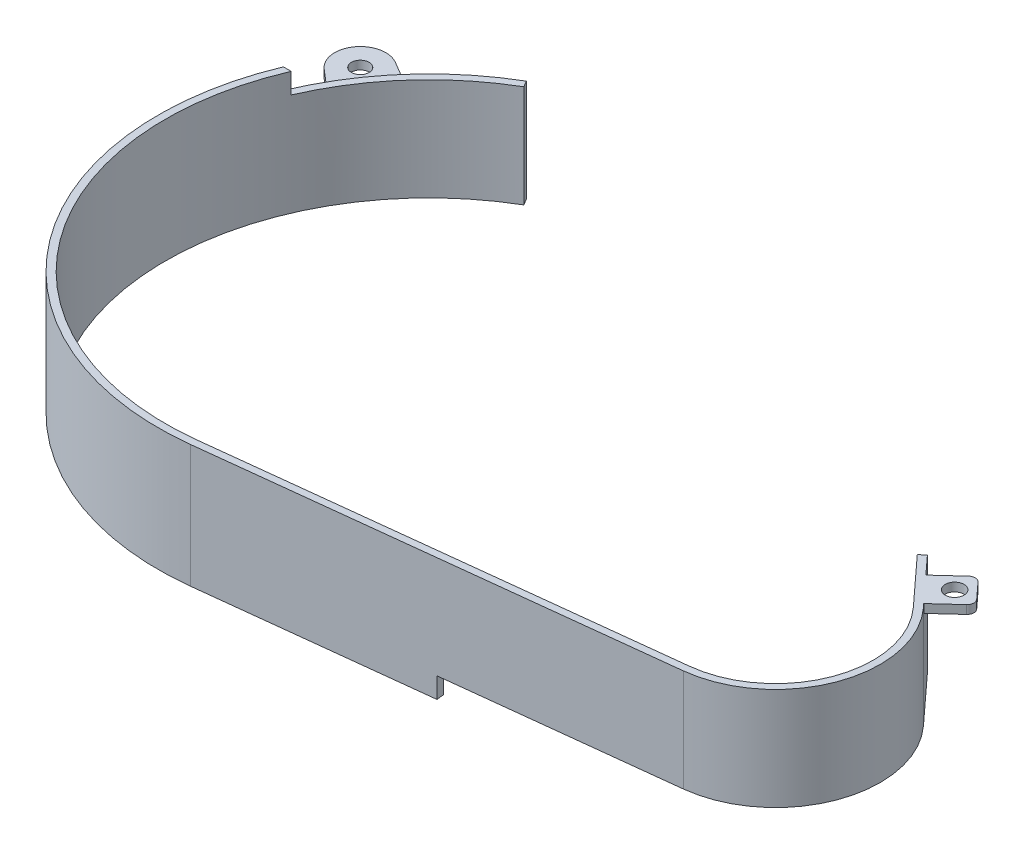
ISO-10303-21;
HEADER;
FILE_DESCRIPTION(('STEP AP214'),'2;1');
FILE_NAME('part.step','',(''),(''),'','','');
FILE_SCHEMA(('AUTOMOTIVE_DESIGN { 1 0 10303 214 1 1 1 1 }'));
ENDSEC;
DATA;
#1=APPLICATION_CONTEXT('core data for automotive mechanical design processes');
#2=APPLICATION_PROTOCOL_DEFINITION('international standard','automotive_design',2000,#1);
#3=PRODUCT_CONTEXT('',#1,'mechanical');
#4=PRODUCT('Part','Part','',(#3));
#5=PRODUCT_RELATED_PRODUCT_CATEGORY('part','',(#4));
#6=PRODUCT_DEFINITION_FORMATION('','',#4);
#7=PRODUCT_DEFINITION_CONTEXT('part definition',#1,'design');
#8=PRODUCT_DEFINITION('design','',#6,#7);
#9=PRODUCT_DEFINITION_SHAPE('','',#8);
#10=(LENGTH_UNIT() NAMED_UNIT(*) SI_UNIT(.MILLI.,.METRE.));
#11=(NAMED_UNIT(*) PLANE_ANGLE_UNIT() SI_UNIT($,.RADIAN.));
#12=(NAMED_UNIT(*) SI_UNIT($,.STERADIAN.) SOLID_ANGLE_UNIT());
#13=UNCERTAINTY_MEASURE_WITH_UNIT(LENGTH_MEASURE(1.E-05),#10,'distance_accuracy_value','');
#14=(GEOMETRIC_REPRESENTATION_CONTEXT(3) GLOBAL_UNCERTAINTY_ASSIGNED_CONTEXT((#13)) GLOBAL_UNIT_ASSIGNED_CONTEXT((#10,
#11,#12)) REPRESENTATION_CONTEXT('',''));
#15=CARTESIAN_POINT('',(0.,0.,0.));
#16=DIRECTION('',(0.,0.,1.));
#17=DIRECTION('',(1.,0.,0.));
#18=AXIS2_PLACEMENT_3D('',#15,#16,#17);
#19=CARTESIAN_POINT('',(-718.812633407999,-38.1,-0.538847823074007));
#20=DIRECTION('',(0.863505690985107,0.,-0.504339093900455));
#21=DIRECTION('',(-0.504339093900455,0.,-0.863505690985107));
#22=AXIS2_PLACEMENT_3D('',#19,#20,#21);
#23=PLANE('',#22);
#24=DIRECTION('',(0.,1.,0.));
#25=VECTOR('',#24,1.);
#26=CARTESIAN_POINT('',(-720.157705771432,-38.1,-2.84181750093129));
#27=LINE('',#26,#25);
#28=CARTESIAN_POINT('',(-720.157705771432,-45.72,-2.84181750093129));
#29=VERTEX_POINT('',#28);
#30=CARTESIAN_POINT('',(-720.157705771432,-7.62,-2.84181750093128));
#31=VERTEX_POINT('',#30);
#32=EDGE_CURVE('E402',#29,#31,#27,.T.);
#33=ORIENTED_EDGE('',*,*,#32,.T.);
#34=DIRECTION('',(-0.504339093900455,0.,-0.863505690985107));
#35=VECTOR('',#34,1.);
#36=CARTESIAN_POINT('',(-718.812633407999,-7.62,-0.538847823074007));
#37=LINE('',#36,#35);
#38=CARTESIAN_POINT('',(-718.812633407999,-7.62,-0.538847823074007));
#39=VERTEX_POINT('',#38);
#40=EDGE_CURVE('E329',#39,#31,#37,.T.);
#41=ORIENTED_EDGE('',*,*,#40,.F.);
#42=DIRECTION('',(0.,1.,0.));
#43=VECTOR('',#42,1.);
#44=CARTESIAN_POINT('',(-718.812633407999,-38.1,-0.538847823074007));
#45=LINE('',#44,#43);
#46=CARTESIAN_POINT('',(-718.812633407999,-45.72,-0.538847823074007));
#47=VERTEX_POINT('',#46);
#48=EDGE_CURVE('E47',#47,#39,#45,.T.);
#49=ORIENTED_EDGE('',*,*,#48,.F.);
#50=DIRECTION('',(0.504339093900453,0.,0.863505690985109));
#51=VECTOR('',#50,1.);
#52=CARTESIAN_POINT('',(-718.812633407999,-45.72,-0.538847823074007));
#53=LINE('',#52,#51);
#54=EDGE_CURVE('E278',#29,#47,#53,.T.);
#55=ORIENTED_EDGE('',*,*,#54,.F.);
#56=EDGE_LOOP('',(#33,#41,#49,#55));
#57=FACE_BOUND('',#56,.T.);
#58=ADVANCED_FACE('F43',(#57),#23,.T.);
#59=CARTESIAN_POINT('',(-669.29,-38.1,84.2514773719377));
#60=DIRECTION('',(0.,1.,0.));
#61=DIRECTION('',(0.,0.,1.));
#62=AXIS2_PLACEMENT_3D('',#59,#60,#61);
#63=CYLINDRICAL_SURFACE('',#62,98.1931284069251);
#64=DIRECTION('',(0.,1.,0.));
#65=VECTOR('',#64,1.);
#66=CARTESIAN_POINT('',(-759.477946398927,-7.62,45.4181824990687));
#67=LINE('',#66,#65);
#68=CARTESIAN_POINT('',(-759.477946398927,-7.62,45.4181824990687));
#69=VERTEX_POINT('',#68);
#70=CARTESIAN_POINT('',(-759.477946398927,0.,45.4181824990687));
#71=VERTEX_POINT('',#70);
#72=EDGE_CURVE('E338',#69,#71,#67,.T.);
#73=ORIENTED_EDGE('',*,*,#72,.T.);
#74=CARTESIAN_POINT('',(-669.29,0.,84.2514773719377));
#75=DIRECTION('',(0.,-1.,0.));
#76=DIRECTION('',(0.,0.,-1.));
#77=AXIS2_PLACEMENT_3D('',#74,#75,#76);
#78=CIRCLE('',#77,98.1931284069251);
#79=CARTESIAN_POINT('',(-658.188390000205,0.,181.815019342037));
#80=VERTEX_POINT('',#79);
#81=EDGE_CURVE('E341',#80,#71,#78,.T.);
#82=ORIENTED_EDGE('',*,*,#81,.F.);
#83=DIRECTION('',(0.,1.,0.));
#84=VECTOR('',#83,1.);
#85=CARTESIAN_POINT('',(-658.188390000205,-38.1,181.815019342037));
#86=LINE('',#85,#84);
#87=CARTESIAN_POINT('',(-658.188390000205,-45.72,181.815019342037));
#88=VERTEX_POINT('',#87);
#89=EDGE_CURVE('E12',#88,#80,#86,.T.);
#90=ORIENTED_EDGE('',*,*,#89,.F.);
#91=CARTESIAN_POINT('',(-669.29,-45.72,84.2514773719377));
#92=DIRECTION('',(0.,1.,0.));
#93=DIRECTION('',(0.,0.,-1.));
#94=AXIS2_PLACEMENT_3D('',#91,#92,#93);
#95=CIRCLE('',#94,98.1931284069251);
#96=EDGE_CURVE('E265',#47,#88,#95,.T.);
#97=ORIENTED_EDGE('',*,*,#96,.F.);
#98=ORIENTED_EDGE('',*,*,#48,.T.);
#99=CARTESIAN_POINT('',(-669.29,-7.62,84.2514773719377));
#100=DIRECTION('',(0.,-1.,0.));
#101=DIRECTION('',(0.,0.,1.));
#102=AXIS2_PLACEMENT_3D('',#99,#100,#101);
#103=CIRCLE('',#102,98.1931284069251);
#104=EDGE_CURVE('E327',#69,#39,#103,.T.);
#105=ORIENTED_EDGE('',*,*,#104,.F.);
#106=EDGE_LOOP('',(#73,#82,#90,#97,#98,#105));
#107=FACE_BOUND('',#106,.T.);
#108=ADVANCED_FACE('F45',(#107),#63,.F.);
#109=CARTESIAN_POINT('',(-658.188390000205,-38.1,181.815019342037));
#110=DIRECTION('',(-0.113058929681808,0.,-0.993588284159593));
#111=DIRECTION('',(-0.993588284159593,0.,0.113058929681808));
#112=AXIS2_PLACEMENT_3D('',#109,#110,#111);
#113=PLANE('',#112);
#114=DIRECTION('',(-0.993588284159593,0.,0.113058929681808));
#115=VECTOR('',#114,1.);
#116=CARTESIAN_POINT('',(-658.188390000205,0.,181.815019342037));
#117=LINE('',#116,#115);
#118=CARTESIAN_POINT('',(-493.414651071668,0.,163.065661222655));
#119=VERTEX_POINT('',#118);
#120=EDGE_CURVE('E346',#119,#80,#117,.T.);
#121=ORIENTED_EDGE('',*,*,#120,.F.);
#122=DIRECTION('',(0.,1.,0.));
#123=VECTOR('',#122,1.);
#124=CARTESIAN_POINT('',(-493.414651071668,-38.1,163.065661222655));
#125=LINE('',#124,#123);
#126=CARTESIAN_POINT('',(-493.414651071668,-38.1,163.065661222655));
#127=VERTEX_POINT('',#126);
#128=EDGE_CURVE('E52',#127,#119,#125,.T.);
#129=ORIENTED_EDGE('',*,*,#128,.F.);
#130=DIRECTION('',(-0.993588284159593,0.,0.113058929681808));
#131=VECTOR('',#130,1.);
#132=CARTESIAN_POINT('',(-658.188390000205,-38.1,181.815019342037));
#133=LINE('',#132,#131);
#134=CARTESIAN_POINT('',(-575.801520535936,-38.1,172.440340282346));
#135=VERTEX_POINT('',#134);
#136=EDGE_CURVE('E361',#127,#135,#133,.T.);
#137=ORIENTED_EDGE('',*,*,#136,.T.);
#138=DIRECTION('',(0.,1.,0.));
#139=VECTOR('',#138,1.);
#140=CARTESIAN_POINT('',(-575.801520535936,-45.72,172.440340282346));
#141=LINE('',#140,#139);
#142=CARTESIAN_POINT('',(-575.801520535936,-45.72,172.440340282346));
#143=VERTEX_POINT('',#142);
#144=EDGE_CURVE('E285',#143,#135,#141,.T.);
#145=ORIENTED_EDGE('',*,*,#144,.F.);
#146=DIRECTION('',(0.993588284159593,0.,-0.113058929681808));
#147=VECTOR('',#146,1.);
#148=CARTESIAN_POINT('',(-575.801520535936,-45.72,172.440340282346));
#149=LINE('',#148,#147);
#150=EDGE_CURVE('E268',#88,#143,#149,.T.);
#151=ORIENTED_EDGE('',*,*,#150,.F.);
#152=ORIENTED_EDGE('',*,*,#89,.T.);
#153=EDGE_LOOP('',(#121,#129,#137,#145,#151,#152));
#154=FACE_BOUND('',#153,.T.);
#155=ADVANCED_FACE('F433',(#154),#113,.T.);
#156=CARTESIAN_POINT('',(-497.518508898001,-38.1,126.999999999997));
#157=DIRECTION('',(0.,1.,0.));
#158=DIRECTION('',(0.,0.,1.));
#159=AXIS2_PLACEMENT_3D('',#156,#157,#158);
#160=CYLINDRICAL_SURFACE('',#159,36.2983962247135);
#161=CARTESIAN_POINT('',(-497.518508898001,0.,126.999999999997));
#162=DIRECTION('',(0.,-1.,0.));
#163=DIRECTION('',(0.,0.,1.));
#164=AXIS2_PLACEMENT_3D('',#161,#162,#163);
#165=CIRCLE('',#164,36.2983962247135);
#166=CARTESIAN_POINT('',(-470.767754496425,0.,102.464908652442));
#167=VERTEX_POINT('',#166);
#168=EDGE_CURVE('E383',#167,#119,#165,.T.);
#169=ORIENTED_EDGE('',*,*,#168,.F.);
#170=DIRECTION('',(0.,1.,0.));
#171=VECTOR('',#170,1.);
#172=CARTESIAN_POINT('',(-470.767754496425,-38.1,102.464908652442));
#173=LINE('',#172,#171);
#174=CARTESIAN_POINT('',(-470.767754496425,-38.1,102.464908652442));
#175=VERTEX_POINT('',#174);
#176=EDGE_CURVE('E389',#175,#167,#173,.T.);
#177=ORIENTED_EDGE('',*,*,#176,.F.);
#178=CARTESIAN_POINT('',(-497.518508898001,-38.1,126.999999999997));
#179=DIRECTION('',(0.,-1.,0.));
#180=DIRECTION('',(0.,0.,1.));
#181=AXIS2_PLACEMENT_3D('',#178,#179,#180);
#182=CIRCLE('',#181,36.2983962247135);
#183=EDGE_CURVE('E358',#175,#127,#182,.T.);
#184=ORIENTED_EDGE('',*,*,#183,.T.);
#185=ORIENTED_EDGE('',*,*,#128,.T.);
#186=EDGE_LOOP('',(#169,#177,#184,#185));
#187=FACE_BOUND('',#186,.T.);
#188=ADVANCED_FACE('F495',(#187),#160,.F.);
#189=CARTESIAN_POINT('',(-470.767754496425,-38.1,102.464908652442));
#190=DIRECTION('',(-0.736967943045437,0.,0.675927696520403));
#191=DIRECTION('',(0.675927696520403,0.,0.736967943045437));
#192=AXIS2_PLACEMENT_3D('',#189,#190,#191);
#193=PLANE('',#192);
#194=DIRECTION('',(0.675927696520403,0.,0.736967943045437));
#195=VECTOR('',#194,1.);
#196=CARTESIAN_POINT('',(-470.767754496425,0.,102.464908652442));
#197=LINE('',#196,#195);
#198=CARTESIAN_POINT('',(-487.06246977756,0.,84.6986847425939));
#199=VERTEX_POINT('',#198);
#200=EDGE_CURVE('E380',#199,#167,#197,.T.);
#201=ORIENTED_EDGE('',*,*,#200,.F.);
#202=DIRECTION('',(0.,1.,0.));
#203=VECTOR('',#202,1.);
#204=CARTESIAN_POINT('',(-487.06246977756,-38.1,84.6986847425939));
#205=LINE('',#204,#203);
#206=CARTESIAN_POINT('',(-487.06246977756,-38.1,84.6986847425939));
#207=VERTEX_POINT('',#206);
#208=EDGE_CURVE('E391',#207,#199,#205,.T.);
#209=ORIENTED_EDGE('',*,*,#208,.F.);
#210=DIRECTION('',(0.675927696520403,0.,0.736967943045437));
#211=VECTOR('',#210,1.);
#212=CARTESIAN_POINT('',(-470.767754496425,-38.1,102.464908652442));
#213=LINE('',#212,#211);
#214=EDGE_CURVE('E355',#207,#175,#213,.T.);
#215=ORIENTED_EDGE('',*,*,#214,.T.);
#216=ORIENTED_EDGE('',*,*,#176,.T.);
#217=EDGE_LOOP('',(#201,#209,#215,#216));
#218=FACE_BOUND('',#217,.T.);
#219=ADVANCED_FACE('F491',(#218),#193,.T.);
#220=CARTESIAN_POINT('',(-487.06246977756,-38.1,84.6986847425939));
#221=DIRECTION('',(-0.675927696520402,0.,-0.736967943045438));
#222=DIRECTION('',(-0.736967943045438,0.,0.675927696520402));
#223=AXIS2_PLACEMENT_3D('',#220,#221,#222);
#224=PLANE('',#223);
#225=DIRECTION('',(-0.736967943045438,0.,0.675927696520402));
#226=VECTOR('',#225,1.);
#227=CARTESIAN_POINT('',(-487.06246977756,0.,84.6986847425939));
#228=LINE('',#227,#226);
#229=CARTESIAN_POINT('',(-485.096976273458,0.,82.8959855759739));
#230=VERTEX_POINT('',#229);
#231=EDGE_CURVE('E377',#230,#199,#228,.T.);
#232=ORIENTED_EDGE('',*,*,#231,.F.);
#233=DIRECTION('',(0.,1.,0.));
#234=VECTOR('',#233,1.);
#235=CARTESIAN_POINT('',(-485.096976273458,-38.1,82.8959855759739));
#236=LINE('',#235,#234);
#237=CARTESIAN_POINT('',(-485.096976273458,-38.1,82.8959855759739));
#238=VERTEX_POINT('',#237);
#239=EDGE_CURVE('E393',#238,#230,#236,.T.);
#240=ORIENTED_EDGE('',*,*,#239,.F.);
#241=DIRECTION('',(-0.736967943045438,0.,0.675927696520402));
#242=VECTOR('',#241,1.);
#243=CARTESIAN_POINT('',(-487.06246977756,-38.1,84.6986847425939));
#244=LINE('',#243,#242);
#245=EDGE_CURVE('E352',#238,#207,#244,.T.);
#246=ORIENTED_EDGE('',*,*,#245,.T.);
#247=ORIENTED_EDGE('',*,*,#208,.T.);
#248=EDGE_LOOP('',(#232,#240,#246,#247));
#249=FACE_BOUND('',#248,.T.);
#250=ADVANCED_FACE('F488',(#249),#224,.T.);
#251=CARTESIAN_POINT('',(-468.802260992323,-38.1,100.662209485822));
#252=DIRECTION('',(0.736967943045436,0.,-0.675927696520403));
#253=DIRECTION('',(-0.675927696520403,0.,-0.736967943045436));
#254=AXIS2_PLACEMENT_3D('',#251,#252,#253);
#255=PLANE('',#254);
#256=DIRECTION('',(0.,1.,0.));
#257=VECTOR('',#256,1.);
#258=CARTESIAN_POINT('',(-470.0899032542,-3.175,99.2582855543139));
#259=LINE('',#258,#257);
#260=CARTESIAN_POINT('',(-470.0899032542,-3.175,99.2582855543139));
#261=VERTEX_POINT('',#260);
#262=CARTESIAN_POINT('',(-470.0899032542,0.,99.2582855543139));
#263=VERTEX_POINT('',#262);
#264=EDGE_CURVE('E231',#261,#263,#259,.T.);
#265=ORIENTED_EDGE('',*,*,#264,.T.);
#266=DIRECTION('',(-0.675927696520403,0.,-0.736967943045436));
#267=VECTOR('',#266,1.);
#268=CARTESIAN_POINT('',(-468.802260992323,0.,100.662209485822));
#269=LINE('',#268,#267);
#270=CARTESIAN_POINT('',(-468.802260992323,0.,100.662209485822));
#271=VERTEX_POINT('',#270);
#272=EDGE_CURVE('E374',#271,#263,#269,.T.);
#273=ORIENTED_EDGE('',*,*,#272,.F.);
#274=DIRECTION('',(0.,1.,0.));
#275=VECTOR('',#274,1.);
#276=CARTESIAN_POINT('',(-468.802260992323,-38.1,100.662209485822));
#277=LINE('',#276,#275);
#278=CARTESIAN_POINT('',(-468.802260992323,-38.1,100.662209485822));
#279=VERTEX_POINT('',#278);
#280=EDGE_CURVE('E396',#279,#271,#277,.T.);
#281=ORIENTED_EDGE('',*,*,#280,.F.);
#282=DIRECTION('',(-0.675927696520403,0.,-0.736967943045436));
#283=VECTOR('',#282,1.);
#284=CARTESIAN_POINT('',(-468.802260992323,-38.1,100.662209485822));
#285=LINE('',#284,#283);
#286=EDGE_CURVE('E349',#279,#238,#285,.T.);
#287=ORIENTED_EDGE('',*,*,#286,.T.);
#288=ORIENTED_EDGE('',*,*,#239,.T.);
#289=CARTESIAN_POINT('',(-478.876963308965,0.,89.6777022947233));
#290=VERTEX_POINT('',#289);
#291=EDGE_CURVE('E373',#290,#230,#269,.T.);
#292=ORIENTED_EDGE('',*,*,#291,.F.);
#293=DIRECTION('',(0.,1.,0.));
#294=VECTOR('',#293,1.);
#295=CARTESIAN_POINT('',(-478.876963308965,-3.175,89.6777022947232));
#296=LINE('',#295,#294);
#297=CARTESIAN_POINT('',(-478.876963308965,-3.175,89.6777022947232));
#298=VERTEX_POINT('',#297);
#299=EDGE_CURVE('E258',#298,#290,#296,.T.);
#300=ORIENTED_EDGE('',*,*,#299,.F.);
#301=DIRECTION('',(-0.675927696520403,0.,-0.736967943045436));
#302=VECTOR('',#301,1.);
#303=CARTESIAN_POINT('',(-304.76027945231,-3.175,279.518146786493));
#304=LINE('',#303,#302);
#305=EDGE_CURVE('E217',#261,#298,#304,.T.);
#306=ORIENTED_EDGE('',*,*,#305,.F.);
#307=EDGE_LOOP('',(#265,#273,#281,#287,#288,#292,#300,#306));
#308=FACE_BOUND('',#307,.T.);
#309=ADVANCED_FACE('F450',(#308),#255,.T.);
#310=CARTESIAN_POINT('',(-497.518508898001,-38.1,126.999999999997));
#311=DIRECTION('',(0.,1.,0.));
#312=DIRECTION('',(0.,0.,1.));
#313=AXIS2_PLACEMENT_3D('',#310,#311,#312);
#314=CYLINDRICAL_SURFACE('',#313,38.9653962247135);
#315=CARTESIAN_POINT('',(-497.518508898001,0.,126.999999999997));
#316=DIRECTION('',(0.,1.,0.));
#317=DIRECTION('',(0.,0.,1.));
#318=AXIS2_PLACEMENT_3D('',#315,#316,#317);
#319=CIRCLE('',#318,38.9653962247135);
#320=CARTESIAN_POINT('',(-493.113122906207,0.,165.715561176509));
#321=VERTEX_POINT('',#320);
#322=EDGE_CURVE('E370',#321,#271,#319,.T.);
#323=ORIENTED_EDGE('',*,*,#322,.F.);
#324=DIRECTION('',(0.,1.,0.));
#325=VECTOR('',#324,1.);
#326=CARTESIAN_POINT('',(-493.113122906207,-38.1,165.715561176509));
#327=LINE('',#326,#325);
#328=CARTESIAN_POINT('',(-493.113122906207,-38.1,165.715561176509));
#329=VERTEX_POINT('',#328);
#330=EDGE_CURVE('E398',#329,#321,#327,.T.);
#331=ORIENTED_EDGE('',*,*,#330,.F.);
#332=CARTESIAN_POINT('',(-497.518508898001,-38.1,126.999999999997));
#333=DIRECTION('',(0.,1.,0.));
#334=DIRECTION('',(0.,0.,1.));
#335=AXIS2_PLACEMENT_3D('',#332,#333,#334);
#336=CIRCLE('',#335,38.9653962247135);
#337=EDGE_CURVE('E345',#329,#279,#336,.T.);
#338=ORIENTED_EDGE('',*,*,#337,.T.);
#339=ORIENTED_EDGE('',*,*,#280,.T.);
#340=EDGE_LOOP('',(#323,#331,#338,#339));
#341=FACE_BOUND('',#340,.T.);
#342=ADVANCED_FACE('F446',(#341),#314,.T.);
#343=CARTESIAN_POINT('',(-657.886861834743,-38.1,184.464919295891));
#344=DIRECTION('',(0.113058929681808,0.,0.993588284159593));
#345=DIRECTION('',(0.993588284159593,0.,-0.113058929681808));
#346=AXIS2_PLACEMENT_3D('',#343,#344,#345);
#347=PLANE('',#346);
#348=DIRECTION('',(0.993588284159593,0.,-0.113058929681808));
#349=VECTOR('',#348,1.);
#350=CARTESIAN_POINT('',(-657.886861834743,0.,184.464919295891));
#351=LINE('',#350,#349);
#352=CARTESIAN_POINT('',(-657.886861834743,0.,184.464919295891));
#353=VERTEX_POINT('',#352);
#354=EDGE_CURVE('E367',#353,#321,#351,.T.);
#355=ORIENTED_EDGE('',*,*,#354,.F.);
#356=DIRECTION('',(0.,1.,0.));
#357=VECTOR('',#356,1.);
#358=CARTESIAN_POINT('',(-657.886861834743,-38.1,184.464919295891));
#359=LINE('',#358,#357);
#360=CARTESIAN_POINT('',(-657.886861834743,-45.72,184.464919295891));
#361=VERTEX_POINT('',#360);
#362=EDGE_CURVE('E400',#361,#353,#359,.T.);
#363=ORIENTED_EDGE('',*,*,#362,.F.);
#364=DIRECTION('',(-0.993588284159593,0.,0.113058929681809));
#365=VECTOR('',#364,1.);
#366=CARTESIAN_POINT('',(-657.886861834743,-45.72,184.464919295891));
#367=LINE('',#366,#365);
#368=CARTESIAN_POINT('',(-575.499992370475,-45.72,175.0902402362));
#369=VERTEX_POINT('',#368);
#370=EDGE_CURVE('E272',#369,#361,#367,.T.);
#371=ORIENTED_EDGE('',*,*,#370,.F.);
#372=DIRECTION('',(0.,1.,0.));
#373=VECTOR('',#372,1.);
#374=CARTESIAN_POINT('',(-575.499992370475,-45.72,175.0902402362));
#375=LINE('',#374,#373);
#376=CARTESIAN_POINT('',(-575.499992370475,-38.1,175.0902402362));
#377=VERTEX_POINT('',#376);
#378=EDGE_CURVE('E281',#369,#377,#375,.T.);
#379=ORIENTED_EDGE('',*,*,#378,.T.);
#380=DIRECTION('',(0.993588284159593,0.,-0.113058929681808));
#381=VECTOR('',#380,1.);
#382=CARTESIAN_POINT('',(-657.886861834743,-38.1,184.464919295891));
#383=LINE('',#382,#381);
#384=EDGE_CURVE('E343',#377,#329,#383,.T.);
#385=ORIENTED_EDGE('',*,*,#384,.T.);
#386=ORIENTED_EDGE('',*,*,#330,.T.);
#387=EDGE_LOOP('',(#355,#363,#371,#379,#385,#386));
#388=FACE_BOUND('',#387,.T.);
#389=ADVANCED_FACE('F441',(#388),#347,.T.);
#390=CARTESIAN_POINT('',(-669.29,-38.1,84.2514773719377));
#391=DIRECTION('',(0.,1.,0.));
#392=DIRECTION('',(0.,0.,1.));
#393=AXIS2_PLACEMENT_3D('',#390,#391,#392);
#394=CYLINDRICAL_SURFACE('',#393,100.860128406925);
#395=CARTESIAN_POINT('',(-669.29,-15.10675668,84.2514773719377));
#396=DIRECTION('',(0.,-1.,0.));
#397=DIRECTION('',(0.,0.,-1.));
#398=AXIS2_PLACEMENT_3D('',#395,#396,#397);
#399=CIRCLE('',#398,100.860128406925);
#400=CARTESIAN_POINT('',(-756.947378036046,-15.10675668,34.3621039733153));
#401=VERTEX_POINT('',#400);
#402=CARTESIAN_POINT('',(-744.675064761212,-15.10675668,17.2450783252101));
#403=VERTEX_POINT('',#402);
#404=EDGE_CURVE('E302',#401,#403,#399,.T.);
#405=ORIENTED_EDGE('',*,*,#404,.T.);
#406=DIRECTION('',(0.,1.,0.));
#407=VECTOR('',#406,1.);
#408=CARTESIAN_POINT('',(-744.675064761212,-15.10675668,17.2450783252101));
#409=LINE('',#408,#407);
#410=CARTESIAN_POINT('',(-744.675064761212,-11.93175668,17.2450783252101));
#411=VERTEX_POINT('',#410);
#412=EDGE_CURVE('E320',#403,#411,#409,.T.);
#413=ORIENTED_EDGE('',*,*,#412,.T.);
#414=CARTESIAN_POINT('',(-669.29,-11.93175668,84.2514773719377));
#415=DIRECTION('',(0.,-1.,0.));
#416=DIRECTION('',(0.,0.,-1.));
#417=AXIS2_PLACEMENT_3D('',#414,#415,#416);
#418=CIRCLE('',#417,100.860128406925);
#419=CARTESIAN_POINT('',(-756.947378036046,-11.93175668,34.3621039733153));
#420=VERTEX_POINT('',#419);
#421=EDGE_CURVE('E313',#420,#411,#418,.T.);
#422=ORIENTED_EDGE('',*,*,#421,.F.);
#423=DIRECTION('',(0.,1.,0.));
#424=VECTOR('',#423,1.);
#425=CARTESIAN_POINT('',(-756.947378036046,-15.10675668,34.3621039733153));
#426=LINE('',#425,#424);
#427=EDGE_CURVE('E323',#401,#420,#426,.T.);
#428=ORIENTED_EDGE('',*,*,#427,.F.);
#429=EDGE_LOOP('',(#405,#413,#422,#428));
#430=FACE_BOUND('',#429,.T.);
#431=DIRECTION('',(0.,1.,0.));
#432=VECTOR('',#431,1.);
#433=CARTESIAN_POINT('',(-762.374589012243,-7.62,45.4181824990687));
#434=LINE('',#433,#432);
#435=CARTESIAN_POINT('',(-762.374589012243,-7.62,45.4181824990687));
#436=VERTEX_POINT('',#435);
#437=CARTESIAN_POINT('',(-762.374589012243,0.,45.4181824990687));
#438=VERTEX_POINT('',#437);
#439=EDGE_CURVE('E336',#436,#438,#434,.T.);
#440=ORIENTED_EDGE('',*,*,#439,.F.);
#441=CARTESIAN_POINT('',(-669.29,-7.62,84.2514773719377));
#442=DIRECTION('',(0.,1.,0.));
#443=DIRECTION('',(0.,0.,-1.));
#444=AXIS2_PLACEMENT_3D('',#441,#442,#443);
#445=CIRCLE('',#444,100.860128406925);
#446=EDGE_CURVE('E331',#31,#436,#445,.T.);
#447=ORIENTED_EDGE('',*,*,#446,.F.);
#448=ORIENTED_EDGE('',*,*,#32,.F.);
#449=CARTESIAN_POINT('',(-669.29,-45.72,84.2514773719377));
#450=DIRECTION('',(0.,-1.,0.));
#451=DIRECTION('',(0.,0.,-1.));
#452=AXIS2_PLACEMENT_3D('',#449,#450,#451);
#453=CIRCLE('',#452,100.860128406925);
#454=EDGE_CURVE('E275',#361,#29,#453,.T.);
#455=ORIENTED_EDGE('',*,*,#454,.F.);
#456=ORIENTED_EDGE('',*,*,#362,.T.);
#457=CARTESIAN_POINT('',(-669.29,0.,84.2514773719377));
#458=DIRECTION('',(0.,1.,0.));
#459=DIRECTION('',(0.,0.,-1.));
#460=AXIS2_PLACEMENT_3D('',#457,#458,#459);
#461=CIRCLE('',#460,100.860128406925);
#462=EDGE_CURVE('E365',#438,#353,#461,.T.);
#463=ORIENTED_EDGE('',*,*,#462,.F.);
#464=EDGE_LOOP('',(#440,#447,#448,#455,#456,#463));
#465=FACE_BOUND('',#464,.T.);
#466=ADVANCED_FACE('F417',(#430,#465),#394,.T.);
#467=CARTESIAN_POINT('',(-669.29,-38.1,84.2514773719377));
#468=DIRECTION('',(0.,-1.,0.));
#469=DIRECTION('',(0.,0.,-1.));
#470=AXIS2_PLACEMENT_3D('',#467,#468,#469);
#471=PLANE('',#470);
#472=DIRECTION('',(0.1130589296818,0.,0.993588284159594));
#473=VECTOR('',#472,1.);
#474=CARTESIAN_POINT('',(-575.499992370475,-38.1,175.0902402362));
#475=LINE('',#474,#473);
#476=EDGE_CURVE('E68',#135,#377,#475,.T.);
#477=ORIENTED_EDGE('',*,*,#476,.F.);
#478=ORIENTED_EDGE('',*,*,#136,.F.);
#479=ORIENTED_EDGE('',*,*,#183,.F.);
#480=ORIENTED_EDGE('',*,*,#214,.F.);
#481=ORIENTED_EDGE('',*,*,#245,.F.);
#482=ORIENTED_EDGE('',*,*,#286,.F.);
#483=ORIENTED_EDGE('',*,*,#337,.F.);
#484=ORIENTED_EDGE('',*,*,#384,.F.);
#485=EDGE_LOOP('',(#477,#478,#479,#480,#481,#482,#483,#484));
#486=FACE_BOUND('',#485,.T.);
#487=ADVANCED_FACE('F480',(#486),#471,.T.);
#488=CARTESIAN_POINT('',(-669.29,0.,84.2514773719377));
#489=DIRECTION('',(0.,-1.,0.));
#490=DIRECTION('',(0.,0.,-1.));
#491=AXIS2_PLACEMENT_3D('',#488,#489,#490);
#492=PLANE('',#491);
#493=ORIENTED_EDGE('',*,*,#81,.T.);
#494=DIRECTION('',(1.,0.,0.));
#495=VECTOR('',#494,1.);
#496=CARTESIAN_POINT('',(-759.477946398927,0.,45.4181824990687));
#497=LINE('',#496,#495);
#498=EDGE_CURVE('E319',#438,#71,#497,.T.);
#499=ORIENTED_EDGE('',*,*,#498,.F.);
#500=ORIENTED_EDGE('',*,*,#462,.T.);
#501=ORIENTED_EDGE('',*,*,#354,.T.);
#502=ORIENTED_EDGE('',*,*,#322,.T.);
#503=ORIENTED_EDGE('',*,*,#272,.T.);
#504=DIRECTION('',(0.736967943045435,0.,-0.675927696520405));
#505=VECTOR('',#504,1.);
#506=CARTESIAN_POINT('',(-165.329623801891,0.,-180.25986123218));
#507=LINE('',#506,#505);
#508=CARTESIAN_POINT('',(-461.759954593954,0.,91.6182748005405));
#509=VERTEX_POINT('',#508);
#510=EDGE_CURVE('E248',#263,#509,#507,.T.);
#511=ORIENTED_EDGE('',*,*,#510,.T.);
#512=CARTESIAN_POINT('',(-463.476810943116,0.,89.7463762252051));
#513=DIRECTION('',(0.,1.,0.));
#514=DIRECTION('',(0.,0.,1.));
#515=AXIS2_PLACEMENT_3D('',#512,#513,#514);
#516=CIRCLE('',#515,2.53999999999996);
#517=CARTESIAN_POINT('',(-461.60491236778,0.,88.0295198760433));
#518=VERTEX_POINT('',#517);
#519=EDGE_CURVE('E212',#509,#518,#516,.T.);
#520=ORIENTED_EDGE('',*,*,#519,.T.);
#521=DIRECTION('',(-0.675927696520408,0.,-0.736967943045432));
#522=VECTOR('',#521,1.);
#523=CARTESIAN_POINT('',(-294.558432216726,0.,270.161279683559));
#524=LINE('',#523,#522);
#525=CARTESIAN_POINT('',(-466.958259724222,0.,82.1927337671234));
#526=VERTEX_POINT('',#525);
#527=EDGE_CURVE('E251',#518,#526,#524,.T.);
#528=ORIENTED_EDGE('',*,*,#527,.T.);
#529=CARTESIAN_POINT('',(-468.830158299558,0.,83.9095901162852));
#530=DIRECTION('',(0.,1.,0.));
#531=DIRECTION('',(0.,0.,1.));
#532=AXIS2_PLACEMENT_3D('',#529,#530,#531);
#533=CIRCLE('',#532,2.53999999999992);
#534=CARTESIAN_POINT('',(-470.547014648719,0.,82.03769154095));
#535=VERTEX_POINT('',#534);
#536=EDGE_CURVE('E254',#526,#535,#533,.T.);
#537=ORIENTED_EDGE('',*,*,#536,.T.);
#538=DIRECTION('',(-0.736967943045435,0.,0.675927696520405));
#539=VECTOR('',#538,1.);
#540=CARTESIAN_POINT('',(-174.116683856656,0.,-189.84044449177));
#541=LINE('',#540,#539);
#542=EDGE_CURVE('E60',#535,#290,#541,.T.);
#543=ORIENTED_EDGE('',*,*,#542,.T.);
#544=ORIENTED_EDGE('',*,*,#291,.T.);
#545=ORIENTED_EDGE('',*,*,#231,.T.);
#546=ORIENTED_EDGE('',*,*,#200,.T.);
#547=ORIENTED_EDGE('',*,*,#168,.T.);
#548=ORIENTED_EDGE('',*,*,#120,.T.);
#549=EDGE_LOOP('',(#493,#499,#500,#501,#502,#503,#511,#520,#528,#537,#543,#544,#545,#546,#547,#548));
#550=FACE_BOUND('',#549,.T.);
#551=CARTESIAN_POINT('',(-468.78761429526,0.,89.0748667950023));
#552=DIRECTION('',(0.,1.,0.));
#553=DIRECTION('',(0.,0.,1.));
#554=AXIS2_PLACEMENT_3D('',#551,#552,#553);
#555=CIRCLE('',#554,3.50000000000002);
#556=CARTESIAN_POINT('',(-468.78761429526,0.,92.5748667950023));
#557=VERTEX_POINT('',#556);
#558=EDGE_CURVE('E245',#557,#557,#555,.T.);
#559=ORIENTED_EDGE('',*,*,#558,.F.);
#560=EDGE_LOOP('',(#559));
#561=FACE_BOUND('',#560,.T.);
#562=ADVANCED_FACE('F428',(#550,#561),#492,.F.);
#563=CARTESIAN_POINT('',(-759.477946398927,-7.62,45.4181824990687));
#564=DIRECTION('',(0.,0.,1.));
#565=DIRECTION('',(1.,0.,0.));
#566=AXIS2_PLACEMENT_3D('',#563,#564,#565);
#567=PLANE('',#566);
#568=ORIENTED_EDGE('',*,*,#498,.T.);
#569=ORIENTED_EDGE('',*,*,#72,.F.);
#570=DIRECTION('',(1.,0.,0.));
#571=VECTOR('',#570,1.);
#572=CARTESIAN_POINT('',(-759.477946398927,-7.62,45.4181824990687));
#573=LINE('',#572,#571);
#574=EDGE_CURVE('E333',#436,#69,#573,.T.);
#575=ORIENTED_EDGE('',*,*,#574,.F.);
#576=ORIENTED_EDGE('',*,*,#439,.T.);
#577=EDGE_LOOP('',(#568,#569,#575,#576));
#578=FACE_BOUND('',#577,.T.);
#579=ADVANCED_FACE('F425',(#578),#567,.F.);
#580=CARTESIAN_POINT('',(-669.29,-7.62,84.2514773719377));
#581=DIRECTION('',(0.,1.,0.));
#582=DIRECTION('',(0.,0.,1.));
#583=AXIS2_PLACEMENT_3D('',#580,#581,#582);
#584=PLANE('',#583);
#585=ORIENTED_EDGE('',*,*,#104,.T.);
#586=ORIENTED_EDGE('',*,*,#40,.T.);
#587=ORIENTED_EDGE('',*,*,#446,.T.);
#588=ORIENTED_EDGE('',*,*,#574,.T.);
#589=EDGE_LOOP('',(#585,#586,#587,#588));
#590=FACE_BOUND('',#589,.T.);
#591=ADVANCED_FACE('F423',(#590),#584,.T.);
#592=CARTESIAN_POINT('',(-759.817588697632,-15.10675668,19.346338397888));
#593=DIRECTION('',(0.,1.,0.));
#594=DIRECTION('',(0.,0.,1.));
#595=AXIS2_PLACEMENT_3D('',#592,#593,#594);
#596=CYLINDRICAL_SURFACE('',#595,9.52500000000008);
#597=CARTESIAN_POINT('',(-759.817588697632,-11.93175668,19.346338397888));
#598=DIRECTION('',(0.,1.,0.));
#599=DIRECTION('',(0.,0.,-1.));
#600=AXIS2_PLACEMENT_3D('',#597,#598,#599);
#601=CIRCLE('',#600,9.52500000000008);
#602=CARTESIAN_POINT('',(-754.963359749799,-11.93175668,11.1510906089541));
#603=VERTEX_POINT('',#602);
#604=CARTESIAN_POINT('',(-766.02116084443,-11.93175668,26.5741539475173));
#605=VERTEX_POINT('',#604);
#606=EDGE_CURVE('E292',#603,#605,#601,.T.);
#607=ORIENTED_EDGE('',*,*,#606,.F.);
#608=DIRECTION('',(0.,1.,0.));
#609=VECTOR('',#608,1.);
#610=CARTESIAN_POINT('',(-754.963359749799,-15.10675668,11.1510906089541));
#611=LINE('',#610,#609);
#612=CARTESIAN_POINT('',(-754.963359749799,-15.10675668,11.1510906089541));
#613=VERTEX_POINT('',#612);
#614=EDGE_CURVE('E317',#613,#603,#611,.T.);
#615=ORIENTED_EDGE('',*,*,#614,.F.);
#616=CARTESIAN_POINT('',(-759.817588697632,-15.10675668,19.346338397888));
#617=DIRECTION('',(0.,1.,0.));
#618=DIRECTION('',(0.,0.,-1.));
#619=AXIS2_PLACEMENT_3D('',#616,#617,#618);
#620=CIRCLE('',#619,9.52500000000008);
#621=CARTESIAN_POINT('',(-766.02116084443,-15.10675668,26.5741539475173));
#622=VERTEX_POINT('',#621);
#623=EDGE_CURVE('E295',#613,#622,#620,.T.);
#624=ORIENTED_EDGE('',*,*,#623,.T.);
#625=DIRECTION('',(0.,1.,0.));
#626=VECTOR('',#625,1.);
#627=CARTESIAN_POINT('',(-766.02116084443,-15.10675668,26.5741539475173));
#628=LINE('',#627,#626);
#629=EDGE_CURVE('E308',#622,#605,#628,.T.);
#630=ORIENTED_EDGE('',*,*,#629,.T.);
#631=EDGE_LOOP('',(#607,#615,#624,#630));
#632=FACE_BOUND('',#631,.T.);
#633=ADVANCED_FACE('F510',(#632),#596,.T.);
#634=CARTESIAN_POINT('',(-754.963359749799,-15.10675668,11.1510906089541));
#635=DIRECTION('',(0.509630335730431,0.,-0.86039346865448));
#636=DIRECTION('',(-0.860393468654481,0.,-0.509630335730431));
#637=AXIS2_PLACEMENT_3D('',#634,#635,#636);
#638=PLANE('',#637);
#639=DIRECTION('',(-0.860393468654481,0.,-0.509630335730431));
#640=VECTOR('',#639,1.);
#641=CARTESIAN_POINT('',(-754.963359749799,-11.93175668,11.1510906089541));
#642=LINE('',#641,#640);
#643=EDGE_CURVE('E299',#411,#603,#642,.T.);
#644=ORIENTED_EDGE('',*,*,#643,.F.);
#645=ORIENTED_EDGE('',*,*,#412,.F.);
#646=DIRECTION('',(-0.860393468654481,0.,-0.509630335730431));
#647=VECTOR('',#646,1.);
#648=CARTESIAN_POINT('',(-754.963359749799,-15.10675668,11.1510906089541));
#649=LINE('',#648,#647);
#650=EDGE_CURVE('E305',#403,#613,#649,.T.);
#651=ORIENTED_EDGE('',*,*,#650,.T.);
#652=ORIENTED_EDGE('',*,*,#614,.T.);
#653=EDGE_LOOP('',(#644,#645,#651,#652));
#654=FACE_BOUND('',#653,.T.);
#655=ADVANCED_FACE('F513',(#654),#638,.T.);
#656=CARTESIAN_POINT('',(-766.02116084443,-15.10675668,26.5741539475173));
#657=DIRECTION('',(-0.651293663705925,0.,0.758825779488621));
#658=DIRECTION('',(0.758825779488621,0.,0.651293663705925));
#659=AXIS2_PLACEMENT_3D('',#656,#657,#658);
#660=PLANE('',#659);
#661=DIRECTION('',(0.758825779488621,0.,0.651293663705925));
#662=VECTOR('',#661,1.);
#663=CARTESIAN_POINT('',(-766.02116084443,-11.93175668,26.5741539475173));
#664=LINE('',#663,#662);
#665=EDGE_CURVE('E311',#605,#420,#664,.T.);
#666=ORIENTED_EDGE('',*,*,#665,.F.);
#667=ORIENTED_EDGE('',*,*,#629,.F.);
#668=DIRECTION('',(0.758825779488621,0.,0.651293663705925));
#669=VECTOR('',#668,1.);
#670=CARTESIAN_POINT('',(-766.02116084443,-15.10675668,26.5741539475173));
#671=LINE('',#670,#669);
#672=EDGE_CURVE('E298',#622,#401,#671,.T.);
#673=ORIENTED_EDGE('',*,*,#672,.T.);
#674=ORIENTED_EDGE('',*,*,#427,.T.);
#675=EDGE_LOOP('',(#666,#667,#673,#674));
#676=FACE_BOUND('',#675,.T.);
#677=ADVANCED_FACE('F515',(#676),#660,.T.);
#678=CARTESIAN_POINT('',(-759.817588697632,-15.10675668,19.346338397888));
#679=DIRECTION('',(0.,-1.,0.));
#680=DIRECTION('',(0.,0.,-1.));
#681=AXIS2_PLACEMENT_3D('',#678,#679,#680);
#682=PLANE('',#681);
#683=CARTESIAN_POINT('',(-759.817588697632,-15.10675668,19.3463383978881));
#684=DIRECTION('',(0.,1.,0.));
#685=DIRECTION('',(0.,0.,1.));
#686=AXIS2_PLACEMENT_3D('',#683,#684,#685);
#687=CIRCLE('',#686,3.29999999999999);
#688=CARTESIAN_POINT('',(-759.817588697632,-15.10675668,22.6463383978881));
#689=VERTEX_POINT('',#688);
#690=EDGE_CURVE('E289',#689,#689,#687,.T.);
#691=ORIENTED_EDGE('',*,*,#690,.T.);
#692=EDGE_LOOP('',(#691));
#693=FACE_BOUND('',#692,.T.);
#694=ORIENTED_EDGE('',*,*,#623,.F.);
#695=ORIENTED_EDGE('',*,*,#650,.F.);
#696=ORIENTED_EDGE('',*,*,#404,.F.);
#697=ORIENTED_EDGE('',*,*,#672,.F.);
#698=EDGE_LOOP('',(#694,#695,#696,#697));
#699=FACE_BOUND('',#698,.T.);
#700=ADVANCED_FACE('F518',(#693,#699),#682,.T.);
#701=CARTESIAN_POINT('',(-759.817588697632,-11.93175668,19.346338397888));
#702=DIRECTION('',(0.,-1.,0.));
#703=DIRECTION('',(0.,0.,-1.));
#704=AXIS2_PLACEMENT_3D('',#701,#702,#703);
#705=PLANE('',#704);
#706=CARTESIAN_POINT('',(-759.817588697632,-11.93175668,19.3463383978881));
#707=DIRECTION('',(0.,1.,0.));
#708=DIRECTION('',(0.,0.,1.));
#709=AXIS2_PLACEMENT_3D('',#706,#707,#708);
#710=CIRCLE('',#709,3.29999999999999);
#711=CARTESIAN_POINT('',(-759.817588697632,-11.93175668,22.6463383978881));
#712=VERTEX_POINT('',#711);
#713=EDGE_CURVE('E288',#712,#712,#710,.T.);
#714=ORIENTED_EDGE('',*,*,#713,.F.);
#715=EDGE_LOOP('',(#714));
#716=FACE_BOUND('',#715,.T.);
#717=ORIENTED_EDGE('',*,*,#606,.T.);
#718=ORIENTED_EDGE('',*,*,#665,.T.);
#719=ORIENTED_EDGE('',*,*,#421,.T.);
#720=ORIENTED_EDGE('',*,*,#643,.T.);
#721=EDGE_LOOP('',(#717,#718,#719,#720));
#722=FACE_BOUND('',#721,.T.);
#723=ADVANCED_FACE('F523',(#716,#722),#705,.F.);
#724=CARTESIAN_POINT('',(-759.817588697632,-15.10675668,19.3463383978881));
#725=DIRECTION('',(0.,1.,0.));
#726=DIRECTION('',(0.,0.,1.));
#727=AXIS2_PLACEMENT_3D('',#724,#725,#726);
#728=CYLINDRICAL_SURFACE('',#727,3.29999999999999);
#729=ORIENTED_EDGE('',*,*,#713,.T.);
#730=EDGE_LOOP('',(#729));
#731=FACE_BOUND('',#730,.T.);
#732=ORIENTED_EDGE('',*,*,#690,.F.);
#733=EDGE_LOOP('',(#732));
#734=FACE_BOUND('',#733,.T.);
#735=ADVANCED_FACE('F526',(#731,#734),#728,.F.);
#736=CARTESIAN_POINT('',(-575.499992370475,-45.72,175.0902402362));
#737=DIRECTION('',(-0.993588284159594,0.,0.1130589296818));
#738=DIRECTION('',(0.1130589296818,0.,0.993588284159594));
#739=AXIS2_PLACEMENT_3D('',#736,#737,#738);
#740=PLANE('',#739);
#741=ORIENTED_EDGE('',*,*,#476,.T.);
#742=ORIENTED_EDGE('',*,*,#378,.F.);
#743=DIRECTION('',(0.1130589296818,0.,0.993588284159594));
#744=VECTOR('',#743,1.);
#745=CARTESIAN_POINT('',(-575.499992370475,-45.72,175.0902402362));
#746=LINE('',#745,#744);
#747=EDGE_CURVE('E270',#143,#369,#746,.T.);
#748=ORIENTED_EDGE('',*,*,#747,.F.);
#749=ORIENTED_EDGE('',*,*,#144,.T.);
#750=EDGE_LOOP('',(#741,#742,#748,#749));
#751=FACE_BOUND('',#750,.T.);
#752=ADVANCED_FACE('F439',(#751),#740,.F.);
#753=CARTESIAN_POINT('',(-669.29,-45.72,84.2514773719377));
#754=DIRECTION('',(0.,-1.,0.));
#755=DIRECTION('',(0.,0.,-1.));
#756=AXIS2_PLACEMENT_3D('',#753,#754,#755);
#757=PLANE('',#756);
#758=ORIENTED_EDGE('',*,*,#96,.T.);
#759=ORIENTED_EDGE('',*,*,#150,.T.);
#760=ORIENTED_EDGE('',*,*,#747,.T.);
#761=ORIENTED_EDGE('',*,*,#370,.T.);
#762=ORIENTED_EDGE('',*,*,#454,.T.);
#763=ORIENTED_EDGE('',*,*,#54,.T.);
#764=EDGE_LOOP('',(#758,#759,#760,#761,#762,#763));
#765=FACE_BOUND('',#764,.T.);
#766=ADVANCED_FACE('F412',(#765),#757,.T.);
#767=CARTESIAN_POINT('',(-165.329623801891,-3.175,-180.25986123218));
#768=DIRECTION('',(0.675927696520405,0.,0.736967943045435));
#769=DIRECTION('',(0.736967943045435,0.,-0.675927696520405));
#770=AXIS2_PLACEMENT_3D('',#767,#768,#769);
#771=PLANE('',#770);
#772=ORIENTED_EDGE('',*,*,#510,.F.);
#773=ORIENTED_EDGE('',*,*,#264,.F.);
#774=DIRECTION('',(0.736967943045435,0.,-0.675927696520405));
#775=VECTOR('',#774,1.);
#776=CARTESIAN_POINT('',(-165.329623801891,-3.175,-180.25986123218));
#777=LINE('',#776,#775);
#778=CARTESIAN_POINT('',(-461.759954593954,-3.175,91.6182748005405));
#779=VERTEX_POINT('',#778);
#780=EDGE_CURVE('E223',#261,#779,#777,.T.);
#781=ORIENTED_EDGE('',*,*,#780,.T.);
#782=DIRECTION('',(0.,1.,0.));
#783=VECTOR('',#782,1.);
#784=CARTESIAN_POINT('',(-461.759954593954,-3.175,91.6182748005405));
#785=LINE('',#784,#783);
#786=EDGE_CURVE('E207',#779,#509,#785,.T.);
#787=ORIENTED_EDGE('',*,*,#786,.T.);
#788=EDGE_LOOP('',(#772,#773,#781,#787));
#789=FACE_BOUND('',#788,.T.);
#790=ADVANCED_FACE('F229',(#789),#771,.T.);
#791=CARTESIAN_POINT('',(-174.116683856656,-3.175,-189.84044449177));
#792=DIRECTION('',(-0.675927696520405,0.,-0.736967943045435));
#793=DIRECTION('',(-0.736967943045435,0.,0.675927696520405));
#794=AXIS2_PLACEMENT_3D('',#791,#792,#793);
#795=PLANE('',#794);
#796=ORIENTED_EDGE('',*,*,#542,.F.);
#797=DIRECTION('',(0.,1.,0.));
#798=VECTOR('',#797,1.);
#799=CARTESIAN_POINT('',(-470.547014648719,-3.175,82.03769154095));
#800=LINE('',#799,#798);
#801=CARTESIAN_POINT('',(-470.547014648719,-3.175,82.03769154095));
#802=VERTEX_POINT('',#801);
#803=EDGE_CURVE('E260',#802,#535,#800,.T.);
#804=ORIENTED_EDGE('',*,*,#803,.F.);
#805=DIRECTION('',(-0.736967943045435,0.,0.675927696520405));
#806=VECTOR('',#805,1.);
#807=CARTESIAN_POINT('',(-174.116683856656,-3.175,-189.84044449177));
#808=LINE('',#807,#806);
#809=EDGE_CURVE('E241',#802,#298,#808,.T.);
#810=ORIENTED_EDGE('',*,*,#809,.T.);
#811=ORIENTED_EDGE('',*,*,#299,.T.);
#812=EDGE_LOOP('',(#796,#804,#810,#811));
#813=FACE_BOUND('',#812,.T.);
#814=ADVANCED_FACE('F455',(#813),#795,.T.);
#815=CARTESIAN_POINT('',(-468.830158299558,-3.175,83.9095901162852));
#816=DIRECTION('',(0.,1.,0.));
#817=DIRECTION('',(0.,0.,1.));
#818=AXIS2_PLACEMENT_3D('',#815,#816,#817);
#819=CYLINDRICAL_SURFACE('',#818,2.53999999999992);
#820=ORIENTED_EDGE('',*,*,#536,.F.);
#821=DIRECTION('',(0.,1.,0.));
#822=VECTOR('',#821,1.);
#823=CARTESIAN_POINT('',(-466.958259724222,-3.175,82.1927337671234));
#824=LINE('',#823,#822);
#825=CARTESIAN_POINT('',(-466.958259724222,-3.175,82.1927337671234));
#826=VERTEX_POINT('',#825);
#827=EDGE_CURVE('E262',#826,#526,#824,.T.);
#828=ORIENTED_EDGE('',*,*,#827,.F.);
#829=CARTESIAN_POINT('',(-468.830158299558,-3.175,83.9095901162852));
#830=DIRECTION('',(0.,1.,0.));
#831=DIRECTION('',(0.,0.,1.));
#832=AXIS2_PLACEMENT_3D('',#829,#830,#831);
#833=CIRCLE('',#832,2.53999999999992);
#834=EDGE_CURVE('E238',#826,#802,#833,.T.);
#835=ORIENTED_EDGE('',*,*,#834,.T.);
#836=ORIENTED_EDGE('',*,*,#803,.T.);
#837=EDGE_LOOP('',(#820,#828,#835,#836));
#838=FACE_BOUND('',#837,.T.);
#839=ADVANCED_FACE('F458',(#838),#819,.T.);
#840=CARTESIAN_POINT('',(-294.558432216726,-3.175,270.161279683559));
#841=DIRECTION('',(0.736967943045432,0.,-0.675927696520408));
#842=DIRECTION('',(-0.675927696520408,0.,-0.736967943045432));
#843=AXIS2_PLACEMENT_3D('',#840,#841,#842);
#844=PLANE('',#843);
#845=ORIENTED_EDGE('',*,*,#527,.F.);
#846=DIRECTION('',(0.,1.,0.));
#847=VECTOR('',#846,1.);
#848=CARTESIAN_POINT('',(-461.60491236778,-3.175,88.0295198760433));
#849=LINE('',#848,#847);
#850=CARTESIAN_POINT('',(-461.60491236778,-3.175,88.0295198760433));
#851=VERTEX_POINT('',#850);
#852=EDGE_CURVE('E216',#851,#518,#849,.T.);
#853=ORIENTED_EDGE('',*,*,#852,.F.);
#854=DIRECTION('',(-0.675927696520408,0.,-0.736967943045432));
#855=VECTOR('',#854,1.);
#856=CARTESIAN_POINT('',(-294.558432216726,-3.175,270.161279683559));
#857=LINE('',#856,#855);
#858=EDGE_CURVE('E227',#851,#826,#857,.T.);
#859=ORIENTED_EDGE('',*,*,#858,.T.);
#860=ORIENTED_EDGE('',*,*,#827,.T.);
#861=EDGE_LOOP('',(#845,#853,#859,#860));
#862=FACE_BOUND('',#861,.T.);
#863=ADVANCED_FACE('F461',(#862),#844,.T.);
#864=CARTESIAN_POINT('',(-468.78761429526,-3.175,89.0748667950023));
#865=DIRECTION('',(0.,1.,0.));
#866=DIRECTION('',(0.,0.,1.));
#867=AXIS2_PLACEMENT_3D('',#864,#865,#866);
#868=CYLINDRICAL_SURFACE('',#867,3.50000000000002);
#869=CARTESIAN_POINT('',(-468.78761429526,-3.175,89.0748667950023));
#870=DIRECTION('',(0.,1.,0.));
#871=DIRECTION('',(0.,0.,1.));
#872=AXIS2_PLACEMENT_3D('',#869,#870,#871);
#873=CIRCLE('',#872,3.50000000000002);
#874=CARTESIAN_POINT('',(-468.78761429526,-3.175,92.5748667950023));
#875=VERTEX_POINT('',#874);
#876=EDGE_CURVE('E232',#875,#875,#873,.T.);
#877=ORIENTED_EDGE('',*,*,#876,.F.);
#878=EDGE_LOOP('',(#877));
#879=FACE_BOUND('',#878,.T.);
#880=ORIENTED_EDGE('',*,*,#558,.T.);
#881=EDGE_LOOP('',(#880));
#882=FACE_BOUND('',#881,.T.);
#883=ADVANCED_FACE('F463',(#879,#882),#868,.F.);
#884=CARTESIAN_POINT('',(-463.476810943116,-3.175,89.7463762252051));
#885=DIRECTION('',(0.,1.,0.));
#886=DIRECTION('',(0.,0.,1.));
#887=AXIS2_PLACEMENT_3D('',#884,#885,#886);
#888=CYLINDRICAL_SURFACE('',#887,2.53999999999996);
#889=ORIENTED_EDGE('',*,*,#519,.F.);
#890=ORIENTED_EDGE('',*,*,#786,.F.);
#891=CARTESIAN_POINT('',(-463.476810943116,-3.175,89.7463762252051));
#892=DIRECTION('',(0.,1.,0.));
#893=DIRECTION('',(0.,0.,1.));
#894=AXIS2_PLACEMENT_3D('',#891,#892,#893);
#895=CIRCLE('',#894,2.53999999999996);
#896=EDGE_CURVE('E210',#779,#851,#895,.T.);
#897=ORIENTED_EDGE('',*,*,#896,.T.);
#898=ORIENTED_EDGE('',*,*,#852,.T.);
#899=EDGE_LOOP('',(#889,#890,#897,#898));
#900=FACE_BOUND('',#899,.T.);
#901=ADVANCED_FACE('F209',(#900),#888,.T.);
#902=CARTESIAN_POINT('',(0.,-3.175,0.));
#903=DIRECTION('',(0.,1.,0.));
#904=DIRECTION('',(0.,0.,1.));
#905=AXIS2_PLACEMENT_3D('',#902,#903,#904);
#906=PLANE('',#905);
#907=ORIENTED_EDGE('',*,*,#876,.T.);
#908=EDGE_LOOP('',(#907));
#909=FACE_BOUND('',#908,.T.);
#910=ORIENTED_EDGE('',*,*,#780,.F.);
#911=ORIENTED_EDGE('',*,*,#305,.T.);
#912=ORIENTED_EDGE('',*,*,#809,.F.);
#913=ORIENTED_EDGE('',*,*,#834,.F.);
#914=ORIENTED_EDGE('',*,*,#858,.F.);
#915=ORIENTED_EDGE('',*,*,#896,.F.);
#916=EDGE_LOOP('',(#910,#911,#912,#913,#914,#915));
#917=FACE_BOUND('',#916,.T.);
#918=ADVANCED_FACE('F222',(#909,#917),#906,.F.);
#919=CLOSED_SHELL('',(#58,#108,#155,#188,#219,#250,#309,#342,#389,#466,#487,#562,#579,#591,#633,
#655,#677,#700,#723,#735,#752,#766,#790,#814,#839,#863,#883,#901,#918));
#920=MANIFOLD_SOLID_BREP('B2',#919);
#921=ADVANCED_BREP_SHAPE_REPRESENTATION('',(#18,#920),#14);
#922=SHAPE_DEFINITION_REPRESENTATION(#9,#921);
ENDSEC;
END-ISO-10303-21;
